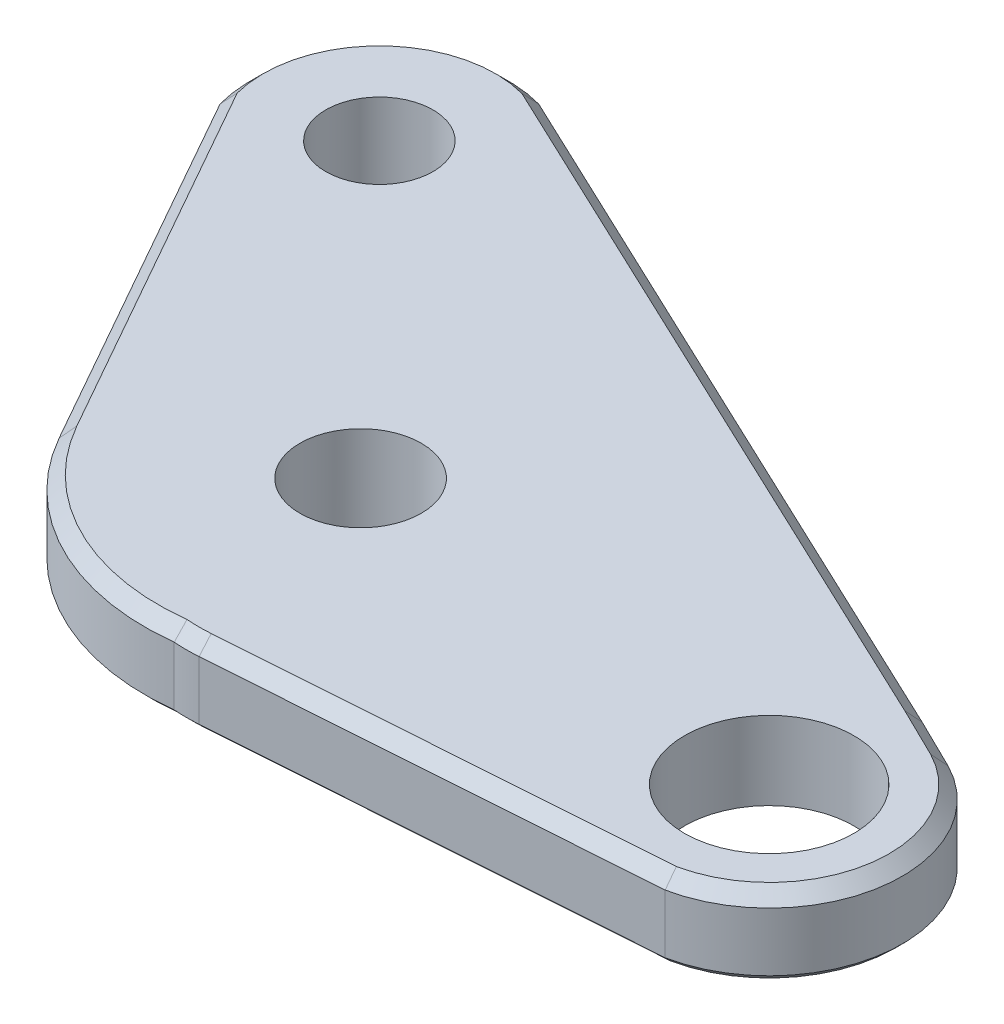
ISO-10303-21;
HEADER;
FILE_DESCRIPTION(('STEP AP214'),'2;1');
FILE_NAME('part.step','',(''),(''),'','','');
FILE_SCHEMA(('AUTOMOTIVE_DESIGN { 1 0 10303 214 1 1 1 1 }'));
ENDSEC;
DATA;
#1=APPLICATION_CONTEXT('core data for automotive mechanical design processes');
#2=APPLICATION_PROTOCOL_DEFINITION('international standard','automotive_design',2000,#1);
#3=PRODUCT_CONTEXT('',#1,'mechanical');
#4=PRODUCT('Part','Part','',(#3));
#5=PRODUCT_RELATED_PRODUCT_CATEGORY('part','',(#4));
#6=PRODUCT_DEFINITION_FORMATION('','',#4);
#7=PRODUCT_DEFINITION_CONTEXT('part definition',#1,'design');
#8=PRODUCT_DEFINITION('design','',#6,#7);
#9=PRODUCT_DEFINITION_SHAPE('','',#8);
#10=(LENGTH_UNIT() NAMED_UNIT(*) SI_UNIT(.MILLI.,.METRE.));
#11=(NAMED_UNIT(*) PLANE_ANGLE_UNIT() SI_UNIT($,.RADIAN.));
#12=(NAMED_UNIT(*) SI_UNIT($,.STERADIAN.) SOLID_ANGLE_UNIT());
#13=UNCERTAINTY_MEASURE_WITH_UNIT(LENGTH_MEASURE(1.E-05),#10,'distance_accuracy_value','');
#14=(GEOMETRIC_REPRESENTATION_CONTEXT(3) GLOBAL_UNCERTAINTY_ASSIGNED_CONTEXT((#13)) GLOBAL_UNIT_ASSIGNED_CONTEXT((#10,
#11,#12)) REPRESENTATION_CONTEXT('',''));
#15=CARTESIAN_POINT('',(0.,0.,0.));
#16=DIRECTION('',(0.,0.,1.));
#17=DIRECTION('',(1.,0.,0.));
#18=AXIS2_PLACEMENT_3D('',#15,#16,#17);
#19=CARTESIAN_POINT('',(0.,0.,0.));
#20=DIRECTION('',(0.,1.,0.));
#21=DIRECTION('',(0.,0.,1.));
#22=AXIS2_PLACEMENT_3D('',#19,#20,#21);
#23=PLANE('',#22);
#24=CARTESIAN_POINT('',(-195.804631344532,0.,-892.212081269776));
#25=DIRECTION('',(0.,1.,0.));
#26=DIRECTION('',(0.,0.,1.));
#27=AXIS2_PLACEMENT_3D('',#24,#25,#26);
#28=CIRCLE('',#27,3.25135682008187);
#29=CARTESIAN_POINT('',(-195.804631344532,0.,-888.960724449694));
#30=VERTEX_POINT('',#29);
#31=EDGE_CURVE('E180',#30,#30,#28,.T.);
#32=ORIENTED_EDGE('',*,*,#31,.T.);
#33=EDGE_LOOP('',(#32));
#34=FACE_BOUND('',#33,.T.);
#35=CARTESIAN_POINT('',(-213.501473140802,0.,-895.082298661492));
#36=DIRECTION('',(0.,1.,0.));
#37=DIRECTION('',(0.,0.,1.));
#38=AXIS2_PLACEMENT_3D('',#35,#36,#37);
#39=CIRCLE('',#38,8.86940842638679);
#40=CARTESIAN_POINT('',(-212.455862171448,0.,-886.274739207544));
#41=VERTEX_POINT('',#40);
#42=CARTESIAN_POINT('',(-221.22401642855,0.,-890.720105290845));
#43=VERTEX_POINT('',#42);
#44=EDGE_CURVE('E530',#41,#43,#39,.F.);
#45=ORIENTED_EDGE('',*,*,#44,.T.);
#46=DIRECTION('',(-0.491824613428475,0.,-0.870694291715486));
#47=VECTOR('',#46,1.);
#48=CARTESIAN_POINT('',(213.720257906825,0.,-120.723064601422));
#49=LINE('',#48,#47);
#50=CARTESIAN_POINT('',(-227.798129123686,0.,-902.358486617162));
#51=VERTEX_POINT('',#50);
#52=EDGE_CURVE('E454',#43,#51,#49,.T.);
#53=ORIENTED_EDGE('',*,*,#52,.T.);
#54=CARTESIAN_POINT('',(-224.681131082097,0.,-906.127727053065));
#55=DIRECTION('',(0.,-1.,0.));
#56=DIRECTION('',(0.,0.,-1.));
#57=AXIS2_PLACEMENT_3D('',#54,#55,#56);
#58=CIRCLE('',#57,4.89109908455354);
#59=CARTESIAN_POINT('',(-221.302351872179,0.,-909.664208539734));
#60=VERTEX_POINT('',#59);
#61=EDGE_CURVE('E188',#60,#51,#58,.T.);
#62=ORIENTED_EDGE('',*,*,#61,.F.);
#63=DIRECTION('',(0.904115765446797,0.,0.42728758777965));
#64=VECTOR('',#63,1.);
#65=CARTESIAN_POINT('',(-195.549034801812,0.,-897.493120335245));
#66=LINE('',#65,#64);
#67=CARTESIAN_POINT('',(-195.550649035869,0.,-897.493883226683));
#68=VERTEX_POINT('',#67);
#69=EDGE_CURVE('E465',#60,#68,#66,.T.);
#70=ORIENTED_EDGE('',*,*,#69,.T.);
#71=DIRECTION('',(0.897920722726972,0.,0.440157217023045));
#72=VECTOR('',#71,1.);
#73=CARTESIAN_POINT('',(-193.602990997308,0.,-896.539148894055));
#74=LINE('',#73,#72);
#75=CARTESIAN_POINT('',(-193.604600848103,0.,-896.539938036602));
#76=VERTEX_POINT('',#75);
#77=EDGE_CURVE('E520',#68,#76,#74,.T.);
#78=ORIENTED_EDGE('',*,*,#77,.T.);
#79=CARTESIAN_POINT('',(-195.804631344532,0.,-892.212081269776));
#80=DIRECTION('',(0.,1.,0.));
#81=DIRECTION('',(0.,0.,1.));
#82=AXIS2_PLACEMENT_3D('',#79,#80,#81);
#83=CIRCLE('',#82,4.85494370506765);
#84=CARTESIAN_POINT('',(-194.82627024636,0.,-887.456738175849));
#85=VERTEX_POINT('',#84);
#86=EDGE_CURVE('E522',#76,#85,#83,.F.);
#87=ORIENTED_EDGE('',*,*,#86,.T.);
#88=DIRECTION('',(-0.997493341424186,0.,0.0707603972177353));
#89=VECTOR('',#88,1.);
#90=CARTESIAN_POINT('',(-211.5124776384,0.,-886.27304840662));
#91=LINE('',#90,#89);
#92=CARTESIAN_POINT('',(-211.5124776384,0.,-886.27304840662));
#93=VERTEX_POINT('',#92);
#94=EDGE_CURVE('E526',#85,#93,#91,.T.);
#95=ORIENTED_EDGE('',*,*,#94,.T.);
#96=CARTESIAN_POINT('',(-211.972547640031,0.,-892.758551332833));
#97=DIRECTION('',(0.,1.,0.));
#98=DIRECTION('',(0.,0.,1.));
#99=AXIS2_PLACEMENT_3D('',#96,#97,#98);
#100=CIRCLE('',#99,6.50180072074809);
#101=EDGE_CURVE('E528',#93,#41,#100,.F.);
#102=ORIENTED_EDGE('',*,*,#101,.T.);
#103=EDGE_LOOP('',(#45,#53,#62,#70,#78,#87,#95,#102));
#104=FACE_BOUND('',#103,.T.);
#105=CARTESIAN_POINT('',(-213.823755457334,0.,-894.549990164915));
#106=DIRECTION('',(0.,1.,0.));
#107=DIRECTION('',(0.,0.,1.));
#108=AXIS2_PLACEMENT_3D('',#105,#106,#107);
#109=CIRCLE('',#108,5.00000000000002);
#110=CARTESIAN_POINT('',(-213.823755457334,0.,-889.549990164915));
#111=VERTEX_POINT('',#110);
#112=EDGE_CURVE('E11',#111,#111,#109,.F.);
#113=ORIENTED_EDGE('',*,*,#112,.F.);
#114=EDGE_LOOP('',(#113));
#115=FACE_BOUND('',#114,.T.);
#116=ADVANCED_FACE('F35',(#34,#104,#115),#23,.F.);
#117=CARTESIAN_POINT('',(-213.501473140802,3.,-895.082298661492));
#118=DIRECTION('',(0.,-1.,0.));
#119=DIRECTION('',(0.,0.,-1.));
#120=AXIS2_PLACEMENT_3D('',#117,#118,#119);
#121=CYLINDRICAL_SURFACE('',#120,9.11940842638678);
#122=DIRECTION('',(0.,-1.,0.));
#123=VECTOR('',#122,1.);
#124=CARTESIAN_POINT('',(-221.441690001479,3.,-890.597149137488));
#125=LINE('',#124,#123);
#126=CARTESIAN_POINT('',(-221.441690001479,2.50000000000006,-890.597149137488));
#127=VERTEX_POINT('',#126);
#128=CARTESIAN_POINT('',(-221.441690001479,0.25000000000007,-890.597149137488));
#129=VERTEX_POINT('',#128);
#130=EDGE_CURVE('E227',#127,#129,#125,.T.);
#131=ORIENTED_EDGE('',*,*,#130,.T.);
#132=CARTESIAN_POINT('',(-213.501473140802,0.25000000000007,-895.082298661492));
#133=DIRECTION('',(0.,1.,0.));
#134=DIRECTION('',(0.,0.,1.));
#135=AXIS2_PLACEMENT_3D('',#132,#133,#134);
#136=CIRCLE('',#135,9.11940842638678);
#137=CARTESIAN_POINT('',(-212.450307740966,0.25000000000007,-886.023675071264));
#138=VERTEX_POINT('',#137);
#139=EDGE_CURVE('E456',#129,#138,#136,.T.);
#140=ORIENTED_EDGE('',*,*,#139,.T.);
#141=DIRECTION('',(0.,-1.,0.));
#142=VECTOR('',#141,1.);
#143=CARTESIAN_POINT('',(-212.450307740966,3.,-886.023675071264));
#144=LINE('',#143,#142);
#145=CARTESIAN_POINT('',(-212.450307740966,2.50000000000004,-886.023675071264));
#146=VERTEX_POINT('',#145);
#147=EDGE_CURVE('E186',#146,#138,#144,.T.);
#148=ORIENTED_EDGE('',*,*,#147,.F.);
#149=CARTESIAN_POINT('',(-213.501473140802,2.50000000000004,-895.082298661492));
#150=DIRECTION('',(0.,1.,0.));
#151=DIRECTION('',(0.,0.,1.));
#152=AXIS2_PLACEMENT_3D('',#149,#150,#151);
#153=CIRCLE('',#152,9.11940842638678);
#154=EDGE_CURVE('E266',#146,#127,#153,.F.);
#155=ORIENTED_EDGE('',*,*,#154,.T.);
#156=EDGE_LOOP('',(#131,#140,#148,#155));
#157=FACE_BOUND('',#156,.T.);
#158=ADVANCED_FACE('F397',(#157),#121,.T.);
#159=CARTESIAN_POINT('',(-211.972547640031,3.,-892.758551332833));
#160=DIRECTION('',(0.,-1.,0.));
#161=DIRECTION('',(0.,0.,-1.));
#162=AXIS2_PLACEMENT_3D('',#159,#160,#161);
#163=CYLINDRICAL_SURFACE('',#162,6.75180072074806);
#164=ORIENTED_EDGE('',*,*,#147,.T.);
#165=CARTESIAN_POINT('',(-211.972547640031,0.25000000000007,-892.758551332833));
#166=DIRECTION('',(0.,1.,0.));
#167=DIRECTION('',(0.,0.,1.));
#168=AXIS2_PLACEMENT_3D('',#165,#166,#167);
#169=CIRCLE('',#168,6.75180072074806);
#170=CARTESIAN_POINT('',(-211.494787539096,0.250000000000066,-886.023675071264));
#171=VERTEX_POINT('',#170);
#172=EDGE_CURVE('E459',#138,#171,#169,.T.);
#173=ORIENTED_EDGE('',*,*,#172,.T.);
#174=DIRECTION('',(0.,-1.,0.));
#175=VECTOR('',#174,1.);
#176=CARTESIAN_POINT('',(-211.494787539096,3.,-886.023675071264));
#177=LINE('',#176,#175);
#178=CARTESIAN_POINT('',(-211.494787539096,2.50000000000004,-886.023675071264));
#179=VERTEX_POINT('',#178);
#180=EDGE_CURVE('E193',#179,#171,#177,.T.);
#181=ORIENTED_EDGE('',*,*,#180,.F.);
#182=CARTESIAN_POINT('',(-211.972547640031,2.50000000000004,-892.758551332833));
#183=DIRECTION('',(0.,1.,0.));
#184=DIRECTION('',(0.,0.,1.));
#185=AXIS2_PLACEMENT_3D('',#182,#183,#184);
#186=CIRCLE('',#185,6.75180072074806);
#187=EDGE_CURVE('E264',#179,#146,#186,.F.);
#188=ORIENTED_EDGE('',*,*,#187,.T.);
#189=EDGE_LOOP('',(#164,#173,#181,#188));
#190=FACE_BOUND('',#189,.T.);
#191=ADVANCED_FACE('F402',(#190),#163,.T.);
#192=CARTESIAN_POINT('',(-63.5971928151706,3.,-896.515266459002));
#193=DIRECTION('',(0.0707603972177353,0.,0.997493341424186));
#194=DIRECTION('',(0.997493341424186,0.,-0.0707603972177353));
#195=AXIS2_PLACEMENT_3D('',#192,#193,#194);
#196=PLANE('',#195);
#197=ORIENTED_EDGE('',*,*,#180,.T.);
#198=DIRECTION('',(0.997493341424186,0.,-0.0707603972177353));
#199=VECTOR('',#198,1.);
#200=CARTESIAN_POINT('',(-194.792294410404,0.250000000000066,-887.208520121583));
#201=LINE('',#200,#199);
#202=CARTESIAN_POINT('',(-194.792294410404,0.25000000000007,-887.208520121583));
#203=VERTEX_POINT('',#202);
#204=EDGE_CURVE('E507',#171,#203,#201,.T.);
#205=ORIENTED_EDGE('',*,*,#204,.T.);
#206=DIRECTION('',(0.,-1.,0.));
#207=VECTOR('',#206,1.);
#208=CARTESIAN_POINT('',(-194.792294410404,3.,-887.208520121583));
#209=LINE('',#208,#207);
#210=CARTESIAN_POINT('',(-194.792294410404,2.50000000000004,-887.208520121583));
#211=VERTEX_POINT('',#210);
#212=EDGE_CURVE('E239',#211,#203,#209,.T.);
#213=ORIENTED_EDGE('',*,*,#212,.F.);
#214=DIRECTION('',(-0.997493341424186,0.,0.0707603972177353));
#215=VECTOR('',#214,1.);
#216=CARTESIAN_POINT('',(-63.5971928151706,2.50000000000004,-896.515266459002));
#217=LINE('',#216,#215);
#218=EDGE_CURVE('E262',#211,#179,#217,.T.);
#219=ORIENTED_EDGE('',*,*,#218,.T.);
#220=EDGE_LOOP('',(#197,#205,#213,#219));
#221=FACE_BOUND('',#220,.T.);
#222=ADVANCED_FACE('F538',(#221),#196,.T.);
#223=CARTESIAN_POINT('',(-195.804631344532,3.,-892.212081269776));
#224=DIRECTION('',(0.,-1.,0.));
#225=DIRECTION('',(0.,0.,-1.));
#226=AXIS2_PLACEMENT_3D('',#223,#224,#225);
#227=CYLINDRICAL_SURFACE('',#226,5.10494370506767);
#228=ORIENTED_EDGE('',*,*,#212,.T.);
#229=CARTESIAN_POINT('',(-195.804631344532,0.25000000000007,-892.212081269776));
#230=DIRECTION('',(0.,1.,0.));
#231=DIRECTION('',(0.,0.,1.));
#232=AXIS2_PLACEMENT_3D('',#229,#230,#231);
#233=CIRCLE('',#232,5.10494370506767);
#234=CARTESIAN_POINT('',(-193.492951693052,0.250000000000058,-896.763629074737));
#235=VERTEX_POINT('',#234);
#236=EDGE_CURVE('E504',#203,#235,#233,.T.);
#237=ORIENTED_EDGE('',*,*,#236,.T.);
#238=DIRECTION('',(0.,-1.,0.));
#239=VECTOR('',#238,1.);
#240=CARTESIAN_POINT('',(-193.492951693052,3.,-896.763629074737));
#241=LINE('',#240,#239);
#242=CARTESIAN_POINT('',(-193.492951693052,2.50000000000004,-896.763629074737));
#243=VERTEX_POINT('',#242);
#244=EDGE_CURVE('E236',#243,#235,#241,.T.);
#245=ORIENTED_EDGE('',*,*,#244,.F.);
#246=CARTESIAN_POINT('',(-195.804631344532,2.50000000000004,-892.212081269776));
#247=DIRECTION('',(0.,1.,0.));
#248=DIRECTION('',(0.,0.,1.));
#249=AXIS2_PLACEMENT_3D('',#246,#247,#248);
#250=CIRCLE('',#249,5.10494370506767);
#251=EDGE_CURVE('E260',#243,#211,#250,.F.);
#252=ORIENTED_EDGE('',*,*,#251,.T.);
#253=EDGE_LOOP('',(#228,#237,#245,#252));
#254=FACE_BOUND('',#253,.T.);
#255=ADVANCED_FACE('F501',(#254),#227,.T.);
#256=CARTESIAN_POINT('',(316.937548748343,3.,-646.552599446591));
#257=DIRECTION('',(0.440157217023045,0.,-0.897920722726972));
#258=DIRECTION('',(-0.897920722726972,0.,-0.440157217023045));
#259=AXIS2_PLACEMENT_3D('',#256,#257,#258);
#260=PLANE('',#259);
#261=ORIENTED_EDGE('',*,*,#244,.T.);
#262=DIRECTION('',(-0.897920722726972,0.,-0.440157217023045));
#263=VECTOR('',#262,1.);
#264=CARTESIAN_POINT('',(-195.442212904867,0.250000000000058,-897.719149276607));
#265=LINE('',#264,#263);
#266=CARTESIAN_POINT('',(-195.442212904867,0.250000000000061,-897.719149276607));
#267=VERTEX_POINT('',#266);
#268=EDGE_CURVE('E171',#235,#267,#265,.T.);
#269=ORIENTED_EDGE('',*,*,#268,.T.);
#270=DIRECTION('',(0.,-1.,0.));
#271=VECTOR('',#270,1.);
#272=CARTESIAN_POINT('',(-195.442212904867,3.,-897.719149276607));
#273=LINE('',#272,#271);
#274=CARTESIAN_POINT('',(-195.442212904867,2.50000000000003,-897.719149276607));
#275=VERTEX_POINT('',#274);
#276=EDGE_CURVE('E234',#275,#267,#273,.T.);
#277=ORIENTED_EDGE('',*,*,#276,.F.);
#278=DIRECTION('',(0.897920722726972,0.,0.440157217023045));
#279=VECTOR('',#278,1.);
#280=CARTESIAN_POINT('',(316.937548748343,2.50000000000002,-646.552599446591));
#281=LINE('',#280,#279);
#282=EDGE_CURVE('E185',#275,#243,#281,.T.);
#283=ORIENTED_EDGE('',*,*,#282,.T.);
#284=EDGE_LOOP('',(#261,#269,#277,#283));
#285=FACE_BOUND('',#284,.T.);
#286=ADVANCED_FACE('F498',(#285),#260,.T.);
#287=CARTESIAN_POINT('',(311.121767617919,3.,-658.315624235017));
#288=DIRECTION('',(0.42728758777965,0.,-0.904115765446797));
#289=DIRECTION('',(-0.904115765446797,0.,-0.42728758777965));
#290=AXIS2_PLACEMENT_3D('',#287,#288,#289);
#291=PLANE('',#290);
#292=ORIENTED_EDGE('',*,*,#276,.T.);
#293=DIRECTION('',(-0.904115765446797,0.,-0.42728758777965));
#294=VECTOR('',#293,1.);
#295=CARTESIAN_POINT('',(-222.591225152667,0.250000000000061,-910.549846845772));
#296=LINE('',#295,#294);
#297=CARTESIAN_POINT('',(-222.591225152667,0.250000000000061,-910.549846845772));
#298=VERTEX_POINT('',#297);
#299=EDGE_CURVE('E169',#267,#298,#296,.T.);
#300=ORIENTED_EDGE('',*,*,#299,.T.);
#301=DIRECTION('',(0.,1.,0.));
#302=VECTOR('',#301,1.);
#303=CARTESIAN_POINT('',(-222.591225152667,0.125000000000031,-910.549846845772));
#304=LINE('',#303,#302);
#305=CARTESIAN_POINT('',(-222.591225152667,0.,-910.549846845772));
#306=VERTEX_POINT('',#305);
#307=EDGE_CURVE('E57',#298,#306,#304,.F.);
#308=ORIENTED_EDGE('',*,*,#307,.T.);
#309=DIRECTION('',(0.904115765446797,0.,0.42728758777965));
#310=VECTOR('',#309,1.);
#311=CARTESIAN_POINT('',(311.121767617919,0.,-658.315624235017));
#312=LINE('',#311,#310);
#313=CARTESIAN_POINT('',(-223.343402799478,0.,-910.905328062416));
#314=VERTEX_POINT('',#313);
#315=EDGE_CURVE('E166',#314,#306,#312,.T.);
#316=ORIENTED_EDGE('',*,*,#315,.F.);
#317=DIRECTION('',(0.,-1.,0.));
#318=VECTOR('',#317,1.);
#319=CARTESIAN_POINT('',(-223.343402799478,3.,-910.905328062416));
#320=LINE('',#319,#318);
#321=CARTESIAN_POINT('',(-223.343402799478,2.50000000000003,-910.905328062416));
#322=VERTEX_POINT('',#321);
#323=EDGE_CURVE('E232',#322,#314,#320,.T.);
#324=ORIENTED_EDGE('',*,*,#323,.F.);
#325=DIRECTION('',(0.904115765446797,0.,0.42728758777965));
#326=VECTOR('',#325,1.);
#327=CARTESIAN_POINT('',(311.121767617919,2.50000000000003,-658.315624235017));
#328=LINE('',#327,#326);
#329=EDGE_CURVE('E272',#322,#275,#328,.T.);
#330=ORIENTED_EDGE('',*,*,#329,.T.);
#331=EDGE_LOOP('',(#292,#300,#308,#316,#324,#330));
#332=FACE_BOUND('',#331,.T.);
#333=ADVANCED_FACE('F164',(#332),#291,.T.);
#334=CARTESIAN_POINT('',(-224.681131082097,3.,-906.127727053065));
#335=DIRECTION('',(0.,-1.,0.));
#336=DIRECTION('',(0.,0.,-1.));
#337=AXIS2_PLACEMENT_3D('',#334,#335,#336);
#338=CYLINDRICAL_SURFACE('',#337,4.96134944976373);
#339=DIRECTION('',(0.,-1.,0.));
#340=VECTOR('',#339,1.);
#341=CARTESIAN_POINT('',(-229.458732091448,3.,-904.789998770447));
#342=LINE('',#341,#340);
#343=CARTESIAN_POINT('',(-229.458732091448,2.50000000000004,-904.789998770447));
#344=VERTEX_POINT('',#343);
#345=CARTESIAN_POINT('',(-229.458732091448,0.,-904.789998770447));
#346=VERTEX_POINT('',#345);
#347=EDGE_CURVE('E230',#344,#346,#342,.T.);
#348=ORIENTED_EDGE('',*,*,#347,.F.);
#349=CARTESIAN_POINT('',(-224.681131082097,2.50000000000004,-906.127727053065));
#350=DIRECTION('',(0.,1.,0.));
#351=DIRECTION('',(0.,0.,1.));
#352=AXIS2_PLACEMENT_3D('',#349,#350,#351);
#353=CIRCLE('',#352,4.96134944976373);
#354=EDGE_CURVE('E270',#344,#322,#353,.F.);
#355=ORIENTED_EDGE('',*,*,#354,.T.);
#356=ORIENTED_EDGE('',*,*,#323,.T.);
#357=CARTESIAN_POINT('',(-224.681131082097,0.,-906.127727053065));
#358=DIRECTION('',(0.,1.,0.));
#359=DIRECTION('',(0.,0.,1.));
#360=AXIS2_PLACEMENT_3D('',#357,#358,#359);
#361=CIRCLE('',#360,4.96134944976373);
#362=EDGE_CURVE('E179',#346,#314,#361,.F.);
#363=ORIENTED_EDGE('',*,*,#362,.F.);
#364=EDGE_LOOP('',(#348,#355,#356,#363));
#365=FACE_BOUND('',#364,.T.);
#366=ADVANCED_FACE('F484',(#365),#338,.T.);
#367=CARTESIAN_POINT('',(-213.823755457334,3.,-894.549990164915));
#368=DIRECTION('',(0.,-1.,0.));
#369=DIRECTION('',(0.,0.,-1.));
#370=AXIS2_PLACEMENT_3D('',#367,#368,#369);
#371=CYLINDRICAL_SURFACE('',#370,2.329855648199);
#372=CARTESIAN_POINT('',(-213.823755457334,3.,-894.549990164915));
#373=DIRECTION('',(0.,1.,0.));
#374=DIRECTION('',(0.,0.,1.));
#375=AXIS2_PLACEMENT_3D('',#372,#373,#374);
#376=CIRCLE('',#375,2.329855648199);
#377=CARTESIAN_POINT('',(-213.823755457334,3.,-892.220134516716));
#378=VERTEX_POINT('',#377);
#379=EDGE_CURVE('E789',#378,#378,#376,.T.);
#380=ORIENTED_EDGE('',*,*,#379,.T.);
#381=EDGE_LOOP('',(#380));
#382=FACE_BOUND('',#381,.T.);
#383=CARTESIAN_POINT('',(-213.823755457334,-0.5,-894.549990164915));
#384=DIRECTION('',(0.,-1.,0.));
#385=DIRECTION('',(0.,0.,-1.));
#386=AXIS2_PLACEMENT_3D('',#383,#384,#385);
#387=CIRCLE('',#386,2.32985564819894);
#388=CARTESIAN_POINT('',(-213.823755457334,-0.5,-896.879845813114));
#389=VERTEX_POINT('',#388);
#390=EDGE_CURVE('E445',#389,#389,#387,.T.);
#391=ORIENTED_EDGE('',*,*,#390,.T.);
#392=EDGE_LOOP('',(#391));
#393=FACE_BOUND('',#392,.T.);
#394=ADVANCED_FACE('F570',(#382,#393),#371,.F.);
#395=CARTESIAN_POINT('',(213.502584333896,3.,-120.600108448065));
#396=DIRECTION('',(0.870694291715486,0.,-0.491824613428475));
#397=DIRECTION('',(-0.491824613428475,0.,-0.870694291715486));
#398=AXIS2_PLACEMENT_3D('',#395,#396,#397);
#399=PLANE('',#398);
#400=DIRECTION('',(0.,1.,0.));
#401=VECTOR('',#400,1.);
#402=CARTESIAN_POINT('',(-228.46090508466,0.,-903.023510768));
#403=LINE('',#402,#401);
#404=CARTESIAN_POINT('',(-228.46090508466,0.,-903.023510768));
#405=VERTEX_POINT('',#404);
#406=CARTESIAN_POINT('',(-228.46090508466,0.250000000000034,-903.023510768));
#407=VERTEX_POINT('',#406);
#408=EDGE_CURVE('E50',#405,#407,#403,.T.);
#409=ORIENTED_EDGE('',*,*,#408,.T.);
#410=DIRECTION('',(0.491824613428475,0.,0.870694291715486));
#411=VECTOR('',#410,1.);
#412=CARTESIAN_POINT('',(213.502584333896,0.250000000000034,-120.600108448065));
#413=LINE('',#412,#411);
#414=EDGE_CURVE('E453',#407,#129,#413,.T.);
#415=ORIENTED_EDGE('',*,*,#414,.T.);
#416=ORIENTED_EDGE('',*,*,#130,.F.);
#417=DIRECTION('',(-0.491824613428475,0.,-0.870694291715486));
#418=VECTOR('',#417,1.);
#419=CARTESIAN_POINT('',(-229.458732091448,2.50000000000006,-904.789998770447));
#420=LINE('',#419,#418);
#421=EDGE_CURVE('E268',#127,#344,#420,.T.);
#422=ORIENTED_EDGE('',*,*,#421,.T.);
#423=ORIENTED_EDGE('',*,*,#347,.T.);
#424=DIRECTION('',(0.491824613428475,0.,0.870694291715486));
#425=VECTOR('',#424,1.);
#426=CARTESIAN_POINT('',(213.502584333896,0.,-120.600108448065));
#427=LINE('',#426,#425);
#428=CARTESIAN_POINT('',(-229.290945200931,0.,-904.492959777665));
#429=VERTEX_POINT('',#428);
#430=EDGE_CURVE('E224',#346,#429,#427,.T.);
#431=ORIENTED_EDGE('',*,*,#430,.T.);
#432=EDGE_CURVE('E223',#429,#405,#427,.T.);
#433=ORIENTED_EDGE('',*,*,#432,.T.);
#434=EDGE_LOOP('',(#409,#415,#416,#422,#423,#431,#433));
#435=FACE_BOUND('',#434,.T.);
#436=ADVANCED_FACE('F463',(#435),#399,.F.);
#437=CARTESIAN_POINT('',(-195.804631344532,3.,-892.212081269776));
#438=DIRECTION('',(0.,-1.,0.));
#439=DIRECTION('',(0.,0.,-1.));
#440=AXIS2_PLACEMENT_3D('',#437,#438,#439);
#441=CYLINDRICAL_SURFACE('',#440,3.25135682008187);
#442=CARTESIAN_POINT('',(-195.804631344532,3.,-892.212081269776));
#443=DIRECTION('',(0.,1.,0.));
#444=DIRECTION('',(0.,0.,1.));
#445=AXIS2_PLACEMENT_3D('',#442,#443,#444);
#446=CIRCLE('',#445,3.25135682008187);
#447=CARTESIAN_POINT('',(-195.804631344532,3.,-888.960724449694));
#448=VERTEX_POINT('',#447);
#449=EDGE_CURVE('E226',#448,#448,#446,.T.);
#450=ORIENTED_EDGE('',*,*,#449,.T.);
#451=EDGE_LOOP('',(#450));
#452=FACE_BOUND('',#451,.T.);
#453=ORIENTED_EDGE('',*,*,#31,.F.);
#454=EDGE_LOOP('',(#453));
#455=FACE_BOUND('',#454,.T.);
#456=ADVANCED_FACE('F423',(#452,#455),#441,.F.);
#457=CARTESIAN_POINT('',(-224.681131082097,3.,-906.127727053065));
#458=DIRECTION('',(0.,-1.,0.));
#459=DIRECTION('',(0.,0.,-1.));
#460=AXIS2_PLACEMENT_3D('',#457,#458,#459);
#461=CYLINDRICAL_SURFACE('',#460,2.05670900357144);
#462=CARTESIAN_POINT('',(-224.681131082097,3.,-906.127727053065));
#463=DIRECTION('',(0.,1.,0.));
#464=DIRECTION('',(0.,0.,1.));
#465=AXIS2_PLACEMENT_3D('',#462,#463,#464);
#466=CIRCLE('',#465,2.05670900357144);
#467=CARTESIAN_POINT('',(-224.681131082097,3.,-904.071018049494));
#468=VERTEX_POINT('',#467);
#469=EDGE_CURVE('E219',#468,#468,#466,.T.);
#470=ORIENTED_EDGE('',*,*,#469,.T.);
#471=EDGE_LOOP('',(#470));
#472=FACE_BOUND('',#471,.T.);
#473=CARTESIAN_POINT('',(-224.681131082097,-0.5,-906.127727053065));
#474=DIRECTION('',(0.,1.,0.));
#475=DIRECTION('',(0.,0.,1.));
#476=AXIS2_PLACEMENT_3D('',#473,#474,#475);
#477=CIRCLE('',#476,2.05670900357144);
#478=CARTESIAN_POINT('',(-224.681131082097,-0.5,-904.071018049494));
#479=VERTEX_POINT('',#478);
#480=EDGE_CURVE('E199',#479,#479,#477,.T.);
#481=ORIENTED_EDGE('',*,*,#480,.F.);
#482=EDGE_LOOP('',(#481));
#483=FACE_BOUND('',#482,.T.);
#484=ADVANCED_FACE('F418',(#472,#483),#461,.F.);
#485=CARTESIAN_POINT('',(0.,3.,0.));
#486=DIRECTION('',(0.,1.,0.));
#487=DIRECTION('',(0.,0.,1.));
#488=AXIS2_PLACEMENT_3D('',#485,#486,#487);
#489=PLANE('',#488);
#490=CARTESIAN_POINT('',(-195.804631344532,3.,-892.212081269776));
#491=DIRECTION('',(0.,1.,0.));
#492=DIRECTION('',(0.,0.,1.));
#493=AXIS2_PLACEMENT_3D('',#490,#491,#492);
#494=CIRCLE('',#493,4.60494370506771);
#495=CARTESIAN_POINT('',(-194.860672958341,3.,-887.704925948292));
#496=VERTEX_POINT('',#495);
#497=CARTESIAN_POINT('',(-193.716292015877,3.,-896.316267592939));
#498=VERTEX_POINT('',#497);
#499=EDGE_CURVE('E255',#496,#498,#494,.T.);
#500=ORIENTED_EDGE('',*,*,#499,.T.);
#501=DIRECTION('',(-0.897920722726972,0.,-0.440157217023045));
#502=VECTOR('',#501,1.);
#503=CARTESIAN_POINT('',(316.717470139832,3.,-646.103639085227));
#504=LINE('',#503,#502);
#505=CARTESIAN_POINT('',(-195.65908516686,3.,-897.268617176754));
#506=VERTEX_POINT('',#505);
#507=EDGE_CURVE('E257',#498,#506,#504,.T.);
#508=ORIENTED_EDGE('',*,*,#507,.T.);
#509=DIRECTION('',(-0.904115765446797,0.,-0.42728758777965));
#510=VECTOR('',#509,1.);
#511=CARTESIAN_POINT('',(310.908123824029,3.,-657.863566352293));
#512=LINE('',#511,#510);
#513=CARTESIAN_POINT('',(-223.517853368049,3.,-910.434747354028));
#514=VERTEX_POINT('',#513);
#515=EDGE_CURVE('E190',#506,#514,#512,.T.);
#516=ORIENTED_EDGE('',*,*,#515,.T.);
#517=CARTESIAN_POINT('',(-224.681131082097,3.,-906.127727053065));
#518=DIRECTION('',(0.,1.,0.));
#519=DIRECTION('',(0.,0.,1.));
#520=AXIS2_PLACEMENT_3D('',#517,#518,#519);
#521=CIRCLE('',#520,4.46134944976373);
#522=CARTESIAN_POINT('',(-228.992782944414,3.,-904.981735285605));
#523=VERTEX_POINT('',#522);
#524=EDGE_CURVE('E245',#514,#523,#521,.T.);
#525=ORIENTED_EDGE('',*,*,#524,.T.);
#526=DIRECTION('',(0.491824613428475,0.,0.870694291715486));
#527=VECTOR('',#526,1.);
#528=CARTESIAN_POINT('',(-221.006342855622,3.,-890.843061444202));
#529=LINE('',#528,#527);
#530=CARTESIAN_POINT('',(-221.006342855622,3.,-890.843061444202));
#531=VERTEX_POINT('',#530);
#532=EDGE_CURVE('E247',#523,#531,#529,.T.);
#533=ORIENTED_EDGE('',*,*,#532,.T.);
#534=CARTESIAN_POINT('',(-213.501473140802,3.,-895.082298661492));
#535=DIRECTION('',(0.,1.,0.));
#536=DIRECTION('',(0.,0.,1.));
#537=AXIS2_PLACEMENT_3D('',#534,#535,#536);
#538=CIRCLE('',#537,8.61940842638683);
#539=CARTESIAN_POINT('',(-212.461293705637,3.,-886.525884204284));
#540=VERTEX_POINT('',#539);
#541=EDGE_CURVE('E249',#531,#540,#538,.T.);
#542=ORIENTED_EDGE('',*,*,#541,.T.);
#543=CARTESIAN_POINT('',(-211.972547640031,3.,-892.758551332833));
#544=DIRECTION('',(0.,1.,0.));
#545=DIRECTION('',(0.,0.,1.));
#546=AXIS2_PLACEMENT_3D('',#543,#544,#545);
#547=CIRCLE('',#546,6.25180072074811);
#548=CARTESIAN_POINT('',(-211.530167737705,3.,-886.522421741976));
#549=VERTEX_POINT('',#548);
#550=EDGE_CURVE('E251',#540,#549,#547,.T.);
#551=ORIENTED_EDGE('',*,*,#550,.T.);
#552=DIRECTION('',(0.997493341424186,0.,-0.0707603972177353));
#553=VECTOR('',#552,1.);
#554=CARTESIAN_POINT('',(-63.6325730137795,3.,-897.014013129714));
#555=LINE('',#554,#553);
#556=EDGE_CURVE('E253',#549,#496,#555,.T.);
#557=ORIENTED_EDGE('',*,*,#556,.T.);
#558=EDGE_LOOP('',(#500,#508,#516,#525,#533,#542,#551,#557));
#559=FACE_BOUND('',#558,.T.);
#560=ORIENTED_EDGE('',*,*,#449,.F.);
#561=EDGE_LOOP('',(#560));
#562=FACE_BOUND('',#561,.T.);
#563=ORIENTED_EDGE('',*,*,#379,.F.);
#564=EDGE_LOOP('',(#563));
#565=FACE_BOUND('',#564,.T.);
#566=ORIENTED_EDGE('',*,*,#469,.F.);
#567=EDGE_LOOP('',(#566));
#568=FACE_BOUND('',#567,.T.);
#569=ADVANCED_FACE('F410',(#559,#562,#565,#568),#489,.T.);
#570=EDGE_CURVE('E176',#429,#306,#58,.T.);
#571=ORIENTED_EDGE('',*,*,#570,.F.);
#572=ORIENTED_EDGE('',*,*,#430,.F.);
#573=ORIENTED_EDGE('',*,*,#362,.T.);
#574=ORIENTED_EDGE('',*,*,#315,.T.);
#575=EDGE_LOOP('',(#571,#572,#573,#574));
#576=FACE_BOUND('',#575,.T.);
#577=ADVANCED_FACE('F174',(#576),#23,.F.);
#578=CARTESIAN_POINT('',(-224.681131082097,0.,-906.127727053065));
#579=DIRECTION('',(0.,-1.,0.));
#580=DIRECTION('',(0.,0.,-1.));
#581=AXIS2_PLACEMENT_3D('',#578,#579,#580);
#582=PLANE('',#581);
#583=ORIENTED_EDGE('',*,*,#432,.F.);
#584=EDGE_CURVE('E184',#405,#429,#58,.T.);
#585=ORIENTED_EDGE('',*,*,#584,.F.);
#586=EDGE_LOOP('',(#583,#585));
#587=FACE_BOUND('',#586,.T.);
#588=ADVANCED_FACE('F409',(#587),#582,.F.);
#589=CARTESIAN_POINT('',(-224.681131082097,-0.5,-906.127727053065));
#590=DIRECTION('',(0.,-1.,0.));
#591=DIRECTION('',(0.,0.,-1.));
#592=AXIS2_PLACEMENT_3D('',#589,#590,#591);
#593=PLANE('',#592);
#594=ORIENTED_EDGE('',*,*,#480,.T.);
#595=EDGE_LOOP('',(#594));
#596=FACE_BOUND('',#595,.T.);
#597=CARTESIAN_POINT('',(-224.681131082097,-0.5,-906.127727053065));
#598=DIRECTION('',(0.,-1.,0.));
#599=DIRECTION('',(0.,0.,-1.));
#600=AXIS2_PLACEMENT_3D('',#597,#598,#599);
#601=CIRCLE('',#600,4.89109908455354);
#602=CARTESIAN_POINT('',(-224.681131082097,-0.5,-911.018826137619));
#603=VERTEX_POINT('',#602);
#604=EDGE_CURVE('E198',#603,#603,#601,.T.);
#605=ORIENTED_EDGE('',*,*,#604,.T.);
#606=EDGE_LOOP('',(#605));
#607=FACE_BOUND('',#606,.T.);
#608=ADVANCED_FACE('F415',(#596,#607),#593,.T.);
#609=CARTESIAN_POINT('',(-224.681131082097,-0.5,-906.127727053065));
#610=DIRECTION('',(0.,1.,0.));
#611=DIRECTION('',(0.,0.,1.));
#612=AXIS2_PLACEMENT_3D('',#609,#610,#611);
#613=CYLINDRICAL_SURFACE('',#612,4.89109908455354);
#614=ORIENTED_EDGE('',*,*,#604,.F.);
#615=EDGE_LOOP('',(#614));
#616=FACE_BOUND('',#615,.T.);
#617=ORIENTED_EDGE('',*,*,#570,.T.);
#618=ORIENTED_EDGE('',*,*,#307,.F.);
#619=CARTESIAN_POINT('',(-224.681131082097,-4.64109908455453,-906.127727053065));
#620=DIRECTION('',(0.302137950835867,-0.707106781186468,-0.639306388725168));
#621=DIRECTION('',(0.302137950835799,0.707106781186627,-0.639306388725024));
#622=AXIS2_PLACEMENT_3D('',#619,#620,#621);
#623=ELLIPSE('',#622,6.91705866028702,4.89109908455354);
#624=EDGE_CURVE('E43',#298,#60,#623,.T.);
#625=ORIENTED_EDGE('',*,*,#624,.T.);
#626=ORIENTED_EDGE('',*,*,#61,.T.);
#627=CARTESIAN_POINT('',(-224.681131082097,-4.56775762240821,-906.127727053065));
#628=DIRECTION('',(0.615673838012496,0.70710678118648,-0.34777251930976));
#629=DIRECTION('',(-0.615673838012379,0.707106781186615,0.347772519309694));
#630=AXIS2_PLACEMENT_3D('',#627,#628,#629);
#631=ELLIPSE('',#630,6.9170586602869,4.89109908455354);
#632=EDGE_CURVE('E514',#51,#407,#631,.F.);
#633=ORIENTED_EDGE('',*,*,#632,.T.);
#634=ORIENTED_EDGE('',*,*,#408,.F.);
#635=ORIENTED_EDGE('',*,*,#584,.T.);
#636=EDGE_LOOP('',(#617,#618,#625,#626,#633,#634,#635));
#637=FACE_BOUND('',#636,.T.);
#638=ADVANCED_FACE('F182',(#616,#637),#613,.T.);
#639=CARTESIAN_POINT('',(-213.501473140802,2.50000000000004,-895.082298661492));
#640=DIRECTION('',(0.,-1.,0.));
#641=DIRECTION('',(0.,0.,-1.));
#642=AXIS2_PLACEMENT_3D('',#639,#640,#641);
#643=CONICAL_SURFACE('',#642,9.11940842638678,0.78539816339748);
#644=CARTESIAN_POINT('',(-212.450307740966,2.50000000000004,-886.023675071264));
#645=CARTESIAN_POINT('',(-212.452179986971,2.58334635868489,-886.107362722604));
#646=CARTESIAN_POINT('',(-212.454031607028,2.66668620459953,-886.191057309264));
#647=CARTESIAN_POINT('',(-212.457693595252,2.83335287126624,-886.358460353604));
#648=CARTESIAN_POINT('',(-212.459503963419,2.91667969201825,-886.442168811284));
#649=CARTESIAN_POINT('',(-212.461293705638,3.,-886.525884204284));
#650=B_SPLINE_CURVE_WITH_KNOTS('',3,(#644,#645,#646,#647,#648,#649),.UNSPECIFIED.,.F.,.F.,(4,2,
4),(0.,0.354377877767699,0.708755757142202),.UNSPECIFIED.);
#651=EDGE_CURVE('E206',#540,#146,#650,.F.);
#652=ORIENTED_EDGE('',*,*,#651,.F.);
#653=ORIENTED_EDGE('',*,*,#541,.F.);
#654=DIRECTION('',(0.615673838012445,0.707106781186539,-0.347772519309733));
#655=VECTOR('',#654,1.);
#656=CARTESIAN_POINT('',(-221.441690001479,2.50000000000004,-890.597149137488));
#657=LINE('',#656,#655);
#658=EDGE_CURVE('E201',#127,#531,#657,.T.);
#659=ORIENTED_EDGE('',*,*,#658,.F.);
#660=ORIENTED_EDGE('',*,*,#154,.F.);
#661=EDGE_LOOP('',(#652,#653,#659,#660));
#662=FACE_BOUND('',#661,.T.);
#663=ADVANCED_FACE('F337',(#662),#643,.T.);
#664=CARTESIAN_POINT('',(213.937931479754,3.,-120.846020754779));
#665=DIRECTION('',(-0.615673838012373,0.707106781186622,0.34777251930969));
#666=DIRECTION('',(-0.491824613428475,0.,-0.870694291715486));
#667=AXIS2_PLACEMENT_3D('',#664,#665,#666);
#668=PLANE('',#667);
#669=ORIENTED_EDGE('',*,*,#658,.T.);
#670=ORIENTED_EDGE('',*,*,#532,.F.);
#671=CARTESIAN_POINT('',(-229.458732091448,2.50000000000005,-904.789998770447));
#672=CARTESIAN_POINT('',(-229.381195310818,2.58335058756388,-904.822204875711));
#673=CARTESIAN_POINT('',(-229.303597827776,2.66669254494973,-904.854285970107));
#674=CARTESIAN_POINT('',(-229.148281445449,2.83335921161892,-904.918198141863));
#675=CARTESIAN_POINT('',(-229.070562546147,2.91668392089972,-904.950029219186));
#676=CARTESIAN_POINT('',(-228.992782944414,3.00000000000001,-904.981735285605));
#677=B_SPLINE_CURVE_WITH_KNOTS('',3,(#671,#672,#673,#674,#675,#676),.UNSPECIFIED.,.F.,.F.,(4,2,
4),(0.,0.35491975244705,0.709839557081938),.UNSPECIFIED.);
#678=EDGE_CURVE('E324',#344,#523,#677,.T.);
#679=ORIENTED_EDGE('',*,*,#678,.F.);
#680=ORIENTED_EDGE('',*,*,#421,.F.);
#681=EDGE_LOOP('',(#669,#670,#679,#680));
#682=FACE_BOUND('',#681,.T.);
#683=ADVANCED_FACE('F320',(#682),#668,.T.);
#684=CARTESIAN_POINT('',(-211.972547640031,2.50000000000004,-892.758551332833));
#685=DIRECTION('',(0.,-1.,0.));
#686=DIRECTION('',(0.,0.,-1.));
#687=AXIS2_PLACEMENT_3D('',#684,#685,#686);
#688=CONICAL_SURFACE('',#687,6.75180072074806,0.785398163397434);
#689=ORIENTED_EDGE('',*,*,#651,.T.);
#690=ORIENTED_EDGE('',*,*,#187,.F.);
#691=DIRECTION('',(0.0500351567121379,-0.707106781186558,0.705334305909458));
#692=VECTOR('',#691,1.);
#693=CARTESIAN_POINT('',(-211.530167737705,3.,-886.522421741976));
#694=LINE('',#693,#692);
#695=EDGE_CURVE('E313',#549,#179,#694,.T.);
#696=ORIENTED_EDGE('',*,*,#695,.F.);
#697=ORIENTED_EDGE('',*,*,#550,.F.);
#698=EDGE_LOOP('',(#689,#690,#696,#697));
#699=FACE_BOUND('',#698,.T.);
#700=ADVANCED_FACE('F318',(#699),#688,.T.);
#701=CARTESIAN_POINT('',(-224.681131082097,2.50000000000004,-906.127727053065));
#702=DIRECTION('',(0.,-1.,0.));
#703=DIRECTION('',(0.,0.,-1.));
#704=AXIS2_PLACEMENT_3D('',#701,#702,#703);
#705=CONICAL_SURFACE('',#704,4.96134944976373,0.785398163397487);
#706=ORIENTED_EDGE('',*,*,#678,.T.);
#707=ORIENTED_EDGE('',*,*,#524,.F.);
#708=CARTESIAN_POINT('',(-223.343402799478,2.50000000000003,-910.905328062416));
#709=CARTESIAN_POINT('',(-223.37265551096,2.58334167567804,-910.826972659424));
#710=CARTESIAN_POINT('',(-223.40181941357,2.66667917870855,-910.748579900286));
#711=CARTESIAN_POINT('',(-223.459969603106,2.83334584537582,-910.591719664162));
#712=CARTESIAN_POINT('',(-223.48895589002,2.91667500901199,-910.513252187171));
#713=CARTESIAN_POINT('',(-223.517853368049,3.00000000000008,-910.434747354028));
#714=B_SPLINE_CURVE_WITH_KNOTS('',3,(#708,#709,#710,#711,#712,#713),.UNSPECIFIED.,.F.,.F.,(4,2,
4),(0.,0.354217272037236,0.708434569158366),.UNSPECIFIED.);
#715=EDGE_CURVE('E307',#322,#514,#714,.T.);
#716=ORIENTED_EDGE('',*,*,#715,.F.);
#717=ORIENTED_EDGE('',*,*,#354,.F.);
#718=EDGE_LOOP('',(#706,#707,#716,#717));
#719=FACE_BOUND('',#718,.T.);
#720=ADVANCED_FACE('F297',(#719),#705,.T.);
#721=CARTESIAN_POINT('',(-63.5971928151706,2.50000000000004,-896.515266459002));
#722=DIRECTION('',(-0.0500351567121151,-0.707106781186536,-0.705334305909481));
#723=DIRECTION('',(-0.997493341424186,0.,0.0707603972177353));
#724=AXIS2_PLACEMENT_3D('',#721,#722,#723);
#725=PLANE('',#724);
#726=ORIENTED_EDGE('',*,*,#695,.T.);
#727=ORIENTED_EDGE('',*,*,#218,.F.);
#728=CARTESIAN_POINT('',(-194.792294410404,2.50000000000004,-887.208520121583));
#729=CARTESIAN_POINT('',(-194.803549186689,2.58333804049497,-887.291269193308));
#730=CARTESIAN_POINT('',(-194.814874787051,2.66667372662648,-887.374010880619));
#731=CARTESIAN_POINT('',(-194.837667636358,2.83334039329331,-887.539479489522));
#732=CARTESIAN_POINT('',(-194.849134885308,2.91667137382845,-887.622206411114));
#733=CARTESIAN_POINT('',(-194.860672958341,3.,-887.704925948292));
#734=B_SPLINE_CURVE_WITH_KNOTS('',3,(#728,#729,#730,#731,#732,#733),.UNSPECIFIED.,.F.,.F.,(4,2,
4),(0.,0.353940155437477,0.707880324171662),.UNSPECIFIED.);
#735=EDGE_CURVE('E301',#496,#211,#734,.F.);
#736=ORIENTED_EDGE('',*,*,#735,.F.);
#737=ORIENTED_EDGE('',*,*,#556,.F.);
#738=EDGE_LOOP('',(#726,#727,#736,#737));
#739=FACE_BOUND('',#738,.T.);
#740=ADVANCED_FACE('F292',(#739),#725,.F.);
#741=CARTESIAN_POINT('',(311.121767617919,2.50000000000004,-658.315624235017));
#742=DIRECTION('',(-0.302137950835775,-0.707106781186683,0.639306388724974));
#743=DIRECTION('',(0.904115765446797,0.,0.42728758777965));
#744=AXIS2_PLACEMENT_3D('',#741,#742,#743);
#745=PLANE('',#744);
#746=ORIENTED_EDGE('',*,*,#715,.T.);
#747=ORIENTED_EDGE('',*,*,#515,.F.);
#748=DIRECTION('',(0.306699783502943,-0.70709776502639,-0.637140481757306));
#749=VECTOR('',#748,1.);
#750=CARTESIAN_POINT('',(-194.574440868841,0.499347569741923,-899.521865557566));
#751=LINE('',#750,#749);
#752=EDGE_CURVE('E281',#275,#506,#751,.F.);
#753=ORIENTED_EDGE('',*,*,#752,.F.);
#754=ORIENTED_EDGE('',*,*,#329,.F.);
#755=EDGE_LOOP('',(#746,#747,#753,#754));
#756=FACE_BOUND('',#755,.T.);
#757=ADVANCED_FACE('F296',(#756),#745,.F.);
#758=CARTESIAN_POINT('',(-195.804631344532,2.50000000000004,-892.212081269776));
#759=DIRECTION('',(0.,-1.,0.));
#760=DIRECTION('',(0.,0.,-1.));
#761=AXIS2_PLACEMENT_3D('',#758,#759,#760);
#762=CONICAL_SURFACE('',#761,5.10494370506767,0.785398163397473);
#763=ORIENTED_EDGE('',*,*,#735,.T.);
#764=ORIENTED_EDGE('',*,*,#251,.F.);
#765=CARTESIAN_POINT('',(-193.492951693052,2.50000000000003,-896.763629074737));
#766=CARTESIAN_POINT('',(-193.530161098927,2.58333338997633,-896.689061911128));
#767=CARTESIAN_POINT('',(-193.56737749543,2.66666675162174,-896.614498205849));
#768=CARTESIAN_POINT('',(-193.641824269707,2.83333341828839,-896.465377711918));
#769=CARTESIAN_POINT('',(-193.679054647482,2.91666672330963,-896.390820923265));
#770=CARTESIAN_POINT('',(-193.716292015884,2.99999999999998,-896.316267592942));
#771=B_SPLINE_CURVE_WITH_KNOTS('',3,(#765,#766,#767,#768,#769,#770),.UNSPECIFIED.,.F.,.F.,(4,2,
4),(0.,0.353558056463223,0.707116113086037),.UNSPECIFIED.);
#772=EDGE_CURVE('E274',#498,#243,#771,.F.);
#773=ORIENTED_EDGE('',*,*,#772,.F.);
#774=ORIENTED_EDGE('',*,*,#499,.F.);
#775=EDGE_LOOP('',(#763,#764,#773,#774));
#776=FACE_BOUND('',#775,.T.);
#777=ADVANCED_FACE('F284',(#776),#762,.T.);
#778=CARTESIAN_POINT('',(316.937548748343,2.50000000000004,-646.552599446591));
#779=DIRECTION('',(-0.311238152945201,-0.707106781186531,0.634925832008182));
#780=DIRECTION('',(0.897920722726972,0.,0.440157217023045));
#781=AXIS2_PLACEMENT_3D('',#778,#779,#780);
#782=PLANE('',#781);
#783=ORIENTED_EDGE('',*,*,#752,.T.);
#784=ORIENTED_EDGE('',*,*,#507,.F.);
#785=ORIENTED_EDGE('',*,*,#772,.T.);
#786=ORIENTED_EDGE('',*,*,#282,.F.);
#787=EDGE_LOOP('',(#783,#784,#785,#786));
#788=FACE_BOUND('',#787,.T.);
#789=ADVANCED_FACE('F287',(#788),#782,.F.);
#790=CARTESIAN_POINT('',(311.014945720974,0.,-658.089595293655));
#791=DIRECTION('',(0.302137950835867,-0.707106781186468,-0.639306388725168));
#792=DIRECTION('',(-0.904115765446797,0.,-0.42728758777965));
#793=AXIS2_PLACEMENT_3D('',#790,#791,#792);
#794=PLANE('',#793);
#795=ORIENTED_EDGE('',*,*,#624,.F.);
#796=ORIENTED_EDGE('',*,*,#299,.F.);
#797=DIRECTION('',(-0.306699783527229,-0.707097765026509,0.637140481745483));
#798=VECTOR('',#797,1.);
#799=CARTESIAN_POINT('',(-194.682874229865,2.00065881630638,-899.29660526185));
#800=LINE('',#799,#798);
#801=EDGE_CURVE('E282',#68,#267,#800,.F.);
#802=ORIENTED_EDGE('',*,*,#801,.F.);
#803=ORIENTED_EDGE('',*,*,#69,.F.);
#804=EDGE_LOOP('',(#795,#796,#802,#803));
#805=FACE_BOUND('',#804,.T.);
#806=ADVANCED_FACE('F37',(#805),#794,.T.);
#807=CARTESIAN_POINT('',(316.827509444087,0.,-646.328119265909));
#808=DIRECTION('',(0.311238152945211,-0.707106781186509,-0.634925832008203));
#809=DIRECTION('',(-0.897920722726972,0.,-0.440157217023045));
#810=AXIS2_PLACEMENT_3D('',#807,#808,#809);
#811=PLANE('',#810);
#812=ORIENTED_EDGE('',*,*,#801,.T.);
#813=ORIENTED_EDGE('',*,*,#268,.F.);
#814=CARTESIAN_POINT('',(-193.492951693052,0.250000000000064,-896.763629074737));
#815=CARTESIAN_POINT('',(-193.511556523497,0.208333319884867,-896.726345572));
#816=CARTESIAN_POINT('',(-193.530163034973,0.166666646494462,-896.689062900787));
#817=CARTESIAN_POINT('',(-193.567379419989,0.0833333131611099,-896.614499221408));
#818=CARTESIAN_POINT('',(-193.585989293529,0.0416666532181634,-896.577218213242));
#819=CARTESIAN_POINT('',(-193.604600848101,0.,-896.5399380366));
#820=B_SPLINE_CURVE_WITH_KNOTS('',3,(#814,#815,#816,#817,#818,#819),.UNSPECIFIED.,.F.,.F.,(4,2,
4),(0.,0.176778968266748,0.353557936542515),.UNSPECIFIED.);
#821=EDGE_CURVE('E375',#76,#235,#820,.F.);
#822=ORIENTED_EDGE('',*,*,#821,.F.);
#823=ORIENTED_EDGE('',*,*,#77,.F.);
#824=EDGE_LOOP('',(#812,#813,#822,#823));
#825=FACE_BOUND('',#824,.T.);
#826=ADVANCED_FACE('F385',(#825),#811,.T.);
#827=CARTESIAN_POINT('',(-195.804631344532,0.,-892.212081269776));
#828=DIRECTION('',(0.,1.,0.));
#829=DIRECTION('',(0.,0.,1.));
#830=AXIS2_PLACEMENT_3D('',#827,#828,#829);
#831=CONICAL_SURFACE('',#830,4.85494370506768,0.785398163397285);
#832=ORIENTED_EDGE('',*,*,#821,.T.);
#833=ORIENTED_EDGE('',*,*,#236,.F.);
#834=CARTESIAN_POINT('',(-194.792294410404,0.250000000000068,-887.208520121583));
#835=CARTESIAN_POINT('',(-194.797922985665,0.208332215732881,-887.249893334147));
#836=CARTESIAN_POINT('',(-194.803568592952,0.166664990310064,-887.291264778241));
#837=CARTESIAN_POINT('',(-194.814893871604,0.0833316569766922,-887.374004129663));
#838=CARTESIAN_POINT('',(-194.820573542969,0.0416655490661412,-887.415372036991));
#839=CARTESIAN_POINT('',(-194.82627024636,0.,-887.456738175849));
#840=B_SPLINE_CURVE_WITH_KNOTS('',3,(#834,#835,#836,#837,#838,#839),.UNSPECIFIED.,.F.,.F.,(4,2,
4),(0.,0.176965088314928,0.353930177379396),.UNSPECIFIED.);
#841=EDGE_CURVE('E368',#85,#203,#840,.F.);
#842=ORIENTED_EDGE('',*,*,#841,.F.);
#843=ORIENTED_EDGE('',*,*,#86,.F.);
#844=EDGE_LOOP('',(#832,#833,#842,#843));
#845=FACE_BOUND('',#844,.T.);
#846=ADVANCED_FACE('F379',(#845),#831,.T.);
#847=CARTESIAN_POINT('',(-63.614882914475,0.,-896.764639794358));
#848=DIRECTION('',(0.0500351567121242,-0.707106781186408,0.705334305909609));
#849=DIRECTION('',(0.997493341424186,0.,-0.0707603972177353));
#850=AXIS2_PLACEMENT_3D('',#847,#848,#849);
#851=PLANE('',#850);
#852=ORIENTED_EDGE('',*,*,#841,.T.);
#853=ORIENTED_EDGE('',*,*,#204,.F.);
#854=DIRECTION('',(0.0500351567121293,0.70710678118668,0.705334305909336));
#855=VECTOR('',#854,1.);
#856=CARTESIAN_POINT('',(-211.5124776384,0.,-886.27304840662));
#857=LINE('',#856,#855);
#858=EDGE_CURVE('E363',#93,#171,#857,.T.);
#859=ORIENTED_EDGE('',*,*,#858,.F.);
#860=ORIENTED_EDGE('',*,*,#94,.F.);
#861=EDGE_LOOP('',(#852,#853,#859,#860));
#862=FACE_BOUND('',#861,.T.);
#863=ADVANCED_FACE('F381',(#862),#851,.T.);
#864=CARTESIAN_POINT('',(-211.972547640031,0.,-892.758551332833));
#865=DIRECTION('',(0.,1.,0.));
#866=DIRECTION('',(0.,0.,1.));
#867=AXIS2_PLACEMENT_3D('',#864,#865,#866);
#868=CONICAL_SURFACE('',#867,6.50180072074809,0.785398163397256);
#869=ORIENTED_EDGE('',*,*,#858,.T.);
#870=ORIENTED_EDGE('',*,*,#172,.F.);
#871=CARTESIAN_POINT('',(-212.450307740966,0.25000000000007,-886.023675071264));
#872=CARTESIAN_POINT('',(-212.451243281467,0.208330239734721,-886.065515796613));
#873=CARTESIAN_POINT('',(-212.452173920924,0.166662026273964,-886.107358170639));
#874=CARTESIAN_POINT('',(-212.454025397752,0.0833286929406309,-886.191046216065));
#875=CARTESIAN_POINT('',(-212.454946235122,0.0416635730680552,-886.232891887466));
#876=CARTESIAN_POINT('',(-212.455862171448,0.,-886.274739207544));
#877=B_SPLINE_CURVE_WITH_KNOTS('',3,(#871,#872,#873,#874,#875,#876),.UNSPECIFIED.,.F.,.F.,(4,2,
4),(0.,0.177175092217847,0.354350184525017),.UNSPECIFIED.);
#878=EDGE_CURVE('E356',#41,#138,#877,.F.);
#879=ORIENTED_EDGE('',*,*,#878,.F.);
#880=ORIENTED_EDGE('',*,*,#101,.F.);
#881=EDGE_LOOP('',(#869,#870,#879,#880));
#882=FACE_BOUND('',#881,.T.);
#883=ADVANCED_FACE('F351',(#882),#868,.T.);
#884=CARTESIAN_POINT('',(-213.501473140802,0.,-895.082298661492));
#885=DIRECTION('',(0.,1.,0.));
#886=DIRECTION('',(0.,0.,1.));
#887=AXIS2_PLACEMENT_3D('',#884,#885,#886);
#888=CONICAL_SURFACE('',#887,8.86940842638679,0.785398163397296);
#889=ORIENTED_EDGE('',*,*,#878,.T.);
#890=ORIENTED_EDGE('',*,*,#139,.F.);
#891=DIRECTION('',(-0.615673838012358,0.707106781186649,0.347772519309662));
#892=VECTOR('',#891,1.);
#893=CARTESIAN_POINT('',(-221.22401642855,0.,-890.720105290845));
#894=LINE('',#893,#892);
#895=EDGE_CURVE('E364',#43,#129,#894,.T.);
#896=ORIENTED_EDGE('',*,*,#895,.F.);
#897=ORIENTED_EDGE('',*,*,#44,.F.);
#898=EDGE_LOOP('',(#889,#890,#896,#897));
#899=FACE_BOUND('',#898,.T.);
#900=ADVANCED_FACE('F346',(#899),#888,.T.);
#901=CARTESIAN_POINT('',(213.502584333896,0.25000000000007,-120.600108448065));
#902=DIRECTION('',(0.615673838012496,0.70710678118648,-0.34777251930976));
#903=DIRECTION('',(0.491824613428475,0.,0.870694291715486));
#904=AXIS2_PLACEMENT_3D('',#901,#902,#903);
#905=PLANE('',#904);
#906=ORIENTED_EDGE('',*,*,#632,.F.);
#907=ORIENTED_EDGE('',*,*,#52,.F.);
#908=ORIENTED_EDGE('',*,*,#895,.T.);
#909=ORIENTED_EDGE('',*,*,#414,.F.);
#910=EDGE_LOOP('',(#906,#907,#908,#909));
#911=FACE_BOUND('',#910,.T.);
#912=ADVANCED_FACE('F342',(#911),#905,.F.);
#913=CARTESIAN_POINT('',(-213.823755457334,-0.5,-894.549990164915));
#914=DIRECTION('',(0.,-1.,0.));
#915=DIRECTION('',(0.,0.,-1.));
#916=AXIS2_PLACEMENT_3D('',#913,#914,#915);
#917=PLANE('',#916);
#918=CARTESIAN_POINT('',(-213.823755457334,-0.5,-894.549990164915));
#919=DIRECTION('',(0.,-1.,0.));
#920=DIRECTION('',(0.,0.,-1.));
#921=AXIS2_PLACEMENT_3D('',#918,#919,#920);
#922=CIRCLE('',#921,5.00000000000002);
#923=CARTESIAN_POINT('',(-213.823755457334,-0.5,-899.549990164915));
#924=VERTEX_POINT('',#923);
#925=EDGE_CURVE('E209',#924,#924,#922,.T.);
#926=ORIENTED_EDGE('',*,*,#925,.T.);
#927=EDGE_LOOP('',(#926));
#928=FACE_BOUND('',#927,.T.);
#929=ORIENTED_EDGE('',*,*,#390,.F.);
#930=EDGE_LOOP('',(#929));
#931=FACE_BOUND('',#930,.T.);
#932=ADVANCED_FACE('F345',(#928,#931),#917,.T.);
#933=CARTESIAN_POINT('',(-213.823755457334,-0.5,-894.549990164915));
#934=DIRECTION('',(0.,1.,0.));
#935=DIRECTION('',(0.,0.,1.));
#936=AXIS2_PLACEMENT_3D('',#933,#934,#935);
#937=CYLINDRICAL_SURFACE('',#936,5.00000000000002);
#938=ORIENTED_EDGE('',*,*,#925,.F.);
#939=EDGE_LOOP('',(#938));
#940=FACE_BOUND('',#939,.T.);
#941=ORIENTED_EDGE('',*,*,#112,.T.);
#942=EDGE_LOOP('',(#941));
#943=FACE_BOUND('',#942,.T.);
#944=ADVANCED_FACE('F432',(#940,#943),#937,.T.);
#945=CLOSED_SHELL('',(#116,#158,#191,#222,#255,#286,#333,#366,#394,#436,#456,#484,#569,#577,
#588,#608,#638,#663,#683,#700,#720,#740,#757,#777,#789,#806,#826,#846,#863,#883,#900,#912,#932,#944));
#946=MANIFOLD_SOLID_BREP('B2',#945);
#947=ADVANCED_BREP_SHAPE_REPRESENTATION('',(#18,#946),#14);
#948=SHAPE_DEFINITION_REPRESENTATION(#9,#947);
ENDSEC;
END-ISO-10303-21;
